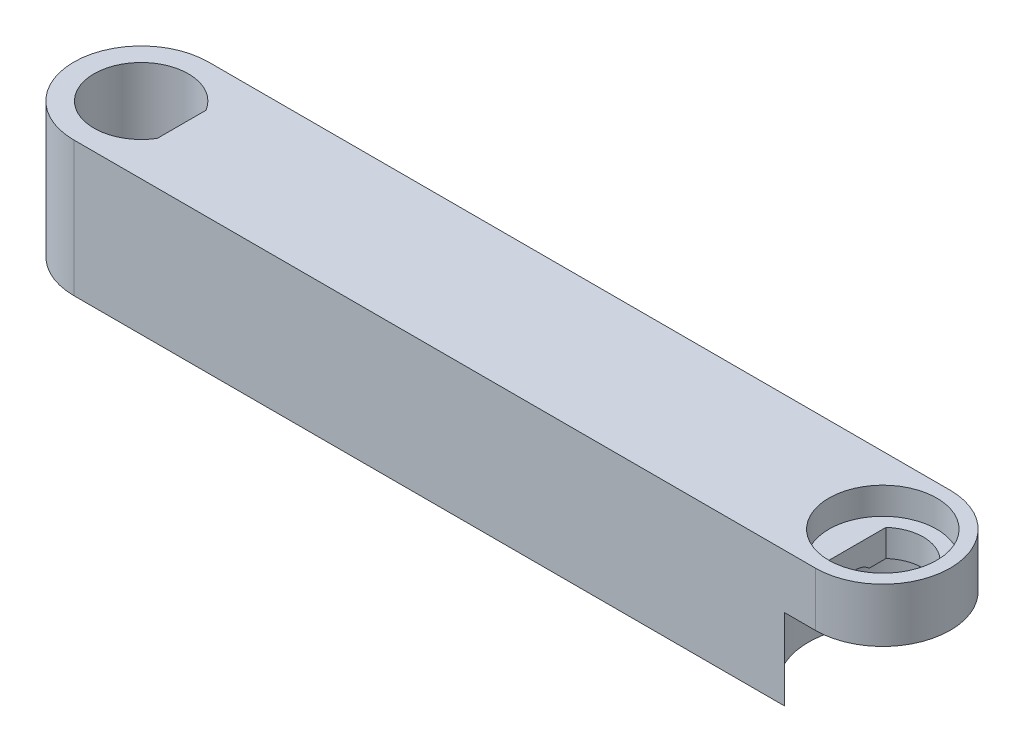
ISO-10303-21;
HEADER;
FILE_DESCRIPTION(('STEP AP214'),'2;1');
FILE_NAME('part.step','',(''),(''),'','','');
FILE_SCHEMA(('AUTOMOTIVE_DESIGN { 1 0 10303 214 1 1 1 1 }'));
ENDSEC;
DATA;
#1=APPLICATION_CONTEXT('core data for automotive mechanical design processes');
#2=APPLICATION_PROTOCOL_DEFINITION('international standard','automotive_design',2000,#1);
#3=PRODUCT_CONTEXT('',#1,'mechanical');
#4=PRODUCT('Part','Part','',(#3));
#5=PRODUCT_RELATED_PRODUCT_CATEGORY('part','',(#4));
#6=PRODUCT_DEFINITION_FORMATION('','',#4);
#7=PRODUCT_DEFINITION_CONTEXT('part definition',#1,'design');
#8=PRODUCT_DEFINITION('design','',#6,#7);
#9=PRODUCT_DEFINITION_SHAPE('','',#8);
#10=(LENGTH_UNIT() NAMED_UNIT(*) SI_UNIT(.MILLI.,.METRE.));
#11=(NAMED_UNIT(*) PLANE_ANGLE_UNIT() SI_UNIT($,.RADIAN.));
#12=(NAMED_UNIT(*) SI_UNIT($,.STERADIAN.) SOLID_ANGLE_UNIT());
#13=UNCERTAINTY_MEASURE_WITH_UNIT(LENGTH_MEASURE(1.E-05),#10,'distance_accuracy_value','');
#14=(GEOMETRIC_REPRESENTATION_CONTEXT(3) GLOBAL_UNCERTAINTY_ASSIGNED_CONTEXT((#13)) GLOBAL_UNIT_ASSIGNED_CONTEXT((#10,
#11,#12)) REPRESENTATION_CONTEXT('',''));
#15=CARTESIAN_POINT('',(0.,0.,0.));
#16=DIRECTION('',(0.,0.,1.));
#17=DIRECTION('',(1.,0.,0.));
#18=AXIS2_PLACEMENT_3D('',#15,#16,#17);
#19=CARTESIAN_POINT('',(0.,50.,25.));
#20=DIRECTION('',(0.,0.,-1.));
#21=DIRECTION('',(-1.,0.,0.));
#22=AXIS2_PLACEMENT_3D('',#19,#20,#21);
#23=PLANE('',#22);
#24=DIRECTION('',(0.,-1.,0.));
#25=VECTOR('',#24,1.);
#26=CARTESIAN_POINT('',(263.54356076261,30.,25.));
#27=LINE('',#26,#25);
#28=CARTESIAN_POINT('',(263.54356076261,30.,25.));
#29=VERTEX_POINT('',#28);
#30=CARTESIAN_POINT('',(263.54356076261,0.,25.));
#31=VERTEX_POINT('',#30);
#32=EDGE_CURVE('E389',#29,#31,#27,.T.);
#33=ORIENTED_EDGE('',*,*,#32,.F.);
#34=DIRECTION('',(1.,0.,0.));
#35=VECTOR('',#34,1.);
#36=CARTESIAN_POINT('',(0.,30.,25.));
#37=LINE('',#36,#35);
#38=CARTESIAN_POINT('',(275.,30.,25.));
#39=VERTEX_POINT('',#38);
#40=EDGE_CURVE('E393',#29,#39,#37,.T.);
#41=ORIENTED_EDGE('',*,*,#40,.T.);
#42=DIRECTION('',(0.,-1.,0.));
#43=VECTOR('',#42,1.);
#44=CARTESIAN_POINT('',(275.,50.,25.));
#45=LINE('',#44,#43);
#46=CARTESIAN_POINT('',(275.,50.,25.));
#47=VERTEX_POINT('',#46);
#48=EDGE_CURVE('E375',#47,#39,#45,.T.);
#49=ORIENTED_EDGE('',*,*,#48,.F.);
#50=DIRECTION('',(1.,0.,0.));
#51=VECTOR('',#50,1.);
#52=CARTESIAN_POINT('',(0.,50.,25.));
#53=LINE('',#52,#51);
#54=CARTESIAN_POINT('',(0.,50.,25.));
#55=VERTEX_POINT('',#54);
#56=EDGE_CURVE('E355',#55,#47,#53,.T.);
#57=ORIENTED_EDGE('',*,*,#56,.F.);
#58=DIRECTION('',(0.,-1.,0.));
#59=VECTOR('',#58,1.);
#60=CARTESIAN_POINT('',(0.,50.,25.));
#61=LINE('',#60,#59);
#62=CARTESIAN_POINT('',(0.,0.,25.));
#63=VERTEX_POINT('',#62);
#64=EDGE_CURVE('E378',#55,#63,#61,.T.);
#65=ORIENTED_EDGE('',*,*,#64,.T.);
#66=DIRECTION('',(1.,0.,0.));
#67=VECTOR('',#66,1.);
#68=CARTESIAN_POINT('',(0.,0.,25.));
#69=LINE('',#68,#67);
#70=EDGE_CURVE('E366',#63,#31,#69,.T.);
#71=ORIENTED_EDGE('',*,*,#70,.T.);
#72=EDGE_LOOP('',(#33,#41,#49,#57,#65,#71));
#73=FACE_BOUND('',#72,.T.);
#74=ADVANCED_FACE('F37',(#73),#23,.F.);
#75=CARTESIAN_POINT('',(0.,50.,-25.));
#76=DIRECTION('',(0.,0.,-1.));
#77=DIRECTION('',(-1.,0.,0.));
#78=AXIS2_PLACEMENT_3D('',#75,#76,#77);
#79=PLANE('',#78);
#80=DIRECTION('',(0.,-1.,0.));
#81=VECTOR('',#80,1.);
#82=CARTESIAN_POINT('',(25.,40.,-25.));
#83=LINE('',#82,#81);
#84=CARTESIAN_POINT('',(25.,40.,-25.));
#85=VERTEX_POINT('',#84);
#86=CARTESIAN_POINT('',(25.,10.,-25.));
#87=VERTEX_POINT('',#86);
#88=EDGE_CURVE('E313',#85,#87,#83,.T.);
#89=ORIENTED_EDGE('',*,*,#88,.T.);
#90=DIRECTION('',(1.,0.,0.));
#91=VECTOR('',#90,1.);
#92=CARTESIAN_POINT('',(25.,10.,-25.));
#93=LINE('',#92,#91);
#94=CARTESIAN_POINT('',(235.,10.,-25.));
#95=VERTEX_POINT('',#94);
#96=EDGE_CURVE('E318',#87,#95,#93,.T.);
#97=ORIENTED_EDGE('',*,*,#96,.T.);
#98=DIRECTION('',(0.,1.,0.));
#99=VECTOR('',#98,1.);
#100=CARTESIAN_POINT('',(235.,40.,-25.));
#101=LINE('',#100,#99);
#102=CARTESIAN_POINT('',(235.,40.,-25.));
#103=VERTEX_POINT('',#102);
#104=EDGE_CURVE('E321',#95,#103,#101,.T.);
#105=ORIENTED_EDGE('',*,*,#104,.T.);
#106=DIRECTION('',(-1.,0.,0.));
#107=VECTOR('',#106,1.);
#108=CARTESIAN_POINT('',(25.,40.,-25.));
#109=LINE('',#108,#107);
#110=EDGE_CURVE('E324',#103,#85,#109,.T.);
#111=ORIENTED_EDGE('',*,*,#110,.T.);
#112=EDGE_LOOP('',(#89,#97,#105,#111));
#113=FACE_BOUND('',#112,.T.);
#114=DIRECTION('',(1.,0.,0.));
#115=VECTOR('',#114,1.);
#116=CARTESIAN_POINT('',(0.,30.,-25.));
#117=LINE('',#116,#115);
#118=CARTESIAN_POINT('',(263.54356076261,30.,-25.));
#119=VERTEX_POINT('',#118);
#120=CARTESIAN_POINT('',(275.,30.,-25.));
#121=VERTEX_POINT('',#120);
#122=EDGE_CURVE('E399',#119,#121,#117,.T.);
#123=ORIENTED_EDGE('',*,*,#122,.F.);
#124=DIRECTION('',(0.,-1.,0.));
#125=VECTOR('',#124,1.);
#126=CARTESIAN_POINT('',(263.54356076261,30.,-25.));
#127=LINE('',#126,#125);
#128=CARTESIAN_POINT('',(263.54356076261,0.,-25.));
#129=VERTEX_POINT('',#128);
#130=EDGE_CURVE('E157',#119,#129,#127,.T.);
#131=ORIENTED_EDGE('',*,*,#130,.T.);
#132=DIRECTION('',(1.,0.,0.));
#133=VECTOR('',#132,1.);
#134=CARTESIAN_POINT('',(0.,0.,-25.));
#135=LINE('',#134,#133);
#136=CARTESIAN_POINT('',(0.,0.,-25.));
#137=VERTEX_POINT('',#136);
#138=EDGE_CURVE('E356',#137,#129,#135,.T.);
#139=ORIENTED_EDGE('',*,*,#138,.F.);
#140=DIRECTION('',(0.,-1.,0.));
#141=VECTOR('',#140,1.);
#142=CARTESIAN_POINT('',(0.,50.,-25.));
#143=LINE('',#142,#141);
#144=CARTESIAN_POINT('',(0.,50.,-25.));
#145=VERTEX_POINT('',#144);
#146=EDGE_CURVE('E363',#145,#137,#143,.T.);
#147=ORIENTED_EDGE('',*,*,#146,.F.);
#148=DIRECTION('',(1.,0.,0.));
#149=VECTOR('',#148,1.);
#150=CARTESIAN_POINT('',(0.,50.,-25.));
#151=LINE('',#150,#149);
#152=CARTESIAN_POINT('',(275.,50.,-25.));
#153=VERTEX_POINT('',#152);
#154=EDGE_CURVE('E360',#145,#153,#151,.T.);
#155=ORIENTED_EDGE('',*,*,#154,.T.);
#156=DIRECTION('',(0.,-1.,0.));
#157=VECTOR('',#156,1.);
#158=CARTESIAN_POINT('',(275.,50.,-25.));
#159=LINE('',#158,#157);
#160=EDGE_CURVE('E372',#153,#121,#159,.T.);
#161=ORIENTED_EDGE('',*,*,#160,.T.);
#162=EDGE_LOOP('',(#123,#131,#139,#147,#155,#161));
#163=FACE_BOUND('',#162,.T.);
#164=ADVANCED_FACE('F193',(#113,#163),#79,.T.);
#165=CARTESIAN_POINT('',(-25.001,24.,0.));
#166=DIRECTION('',(1.,0.,0.));
#167=DIRECTION('',(0.,0.,-1.));
#168=AXIS2_PLACEMENT_3D('',#165,#166,#167);
#169=CYLINDRICAL_SURFACE('',#168,5.);
#170=CARTESIAN_POINT('',(15.,24.,0.));
#171=DIRECTION('',(-1.,0.,0.));
#172=DIRECTION('',(0.,0.,1.));
#173=AXIS2_PLACEMENT_3D('',#170,#171,#172);
#174=CIRCLE('',#173,5.);
#175=CARTESIAN_POINT('',(15.,24.,5.));
#176=VERTEX_POINT('',#175);
#177=EDGE_CURVE('E278',#176,#176,#174,.T.);
#178=ORIENTED_EDGE('',*,*,#177,.T.);
#179=EDGE_LOOP('',(#178));
#180=FACE_BOUND('',#179,.T.);
#181=CARTESIAN_POINT('',(24.,24.,0.));
#182=DIRECTION('',(1.,0.,0.));
#183=DIRECTION('',(0.,1.,0.));
#184=AXIS2_PLACEMENT_3D('',#181,#182,#183);
#185=CIRCLE('',#184,5.);
#186=CARTESIAN_POINT('',(24.,29.,0.));
#187=VERTEX_POINT('',#186);
#188=EDGE_CURVE('E272',#187,#187,#185,.T.);
#189=ORIENTED_EDGE('',*,*,#188,.T.);
#190=EDGE_LOOP('',(#189));
#191=FACE_BOUND('',#190,.T.);
#192=ADVANCED_FACE('F198',(#180,#191),#169,.F.);
#193=CARTESIAN_POINT('',(275.,50.,0.));
#194=DIRECTION('',(0.,-1.,0.));
#195=DIRECTION('',(0.,0.,-1.));
#196=AXIS2_PLACEMENT_3D('',#193,#194,#195);
#197=CYLINDRICAL_SURFACE('',#196,15.);
#198=CARTESIAN_POINT('',(275.,30.,0.));
#199=DIRECTION('',(0.,1.,0.));
#200=DIRECTION('',(0.,0.,1.));
#201=AXIS2_PLACEMENT_3D('',#198,#199,#200);
#202=CIRCLE('',#201,15.);
#203=CARTESIAN_POINT('',(265.,30.,11.1803398874989));
#204=VERTEX_POINT('',#203);
#205=CARTESIAN_POINT('',(265.,30.,-11.1803398874989));
#206=VERTEX_POINT('',#205);
#207=EDGE_CURVE('E401',#204,#206,#202,.T.);
#208=ORIENTED_EDGE('',*,*,#207,.F.);
#209=DIRECTION('',(0.,-1.,0.));
#210=VECTOR('',#209,1.);
#211=CARTESIAN_POINT('',(265.,50.,11.1803398874989));
#212=LINE('',#211,#210);
#213=CARTESIAN_POINT('',(265.,40.,11.1803398874989));
#214=VERTEX_POINT('',#213);
#215=EDGE_CURVE('E297',#214,#204,#212,.T.);
#216=ORIENTED_EDGE('',*,*,#215,.F.);
#217=CARTESIAN_POINT('',(275.,40.,0.));
#218=DIRECTION('',(0.,1.,0.));
#219=DIRECTION('',(0.,0.,1.));
#220=AXIS2_PLACEMENT_3D('',#217,#218,#219);
#221=CIRCLE('',#220,15.);
#222=CARTESIAN_POINT('',(265.,40.,-11.1803398874989));
#223=VERTEX_POINT('',#222);
#224=EDGE_CURVE('E292',#214,#223,#221,.T.);
#225=ORIENTED_EDGE('',*,*,#224,.T.);
#226=DIRECTION('',(0.,-1.,0.));
#227=VECTOR('',#226,1.);
#228=CARTESIAN_POINT('',(265.,50.,-11.1803398874989));
#229=LINE('',#228,#227);
#230=EDGE_CURVE('E300',#223,#206,#229,.T.);
#231=ORIENTED_EDGE('',*,*,#230,.T.);
#232=EDGE_LOOP('',(#208,#216,#225,#231));
#233=FACE_BOUND('',#232,.T.);
#234=ADVANCED_FACE('F245',(#233),#197,.F.);
#235=CARTESIAN_POINT('',(265.,50.,-11.1803398874989));
#236=DIRECTION('',(1.,0.,0.));
#237=DIRECTION('',(0.,0.,-1.));
#238=AXIS2_PLACEMENT_3D('',#235,#236,#237);
#239=PLANE('',#238);
#240=DIRECTION('',(0.,0.,1.));
#241=VECTOR('',#240,1.);
#242=CARTESIAN_POINT('',(265.,30.,-11.1803398874989));
#243=LINE('',#242,#241);
#244=CARTESIAN_POINT('',(265.,30.,-4.89897948556636));
#245=VERTEX_POINT('',#244);
#246=EDGE_CURVE('E148',#206,#245,#243,.T.);
#247=ORIENTED_EDGE('',*,*,#246,.F.);
#248=ORIENTED_EDGE('',*,*,#230,.F.);
#249=DIRECTION('',(0.,0.,1.));
#250=VECTOR('',#249,1.);
#251=CARTESIAN_POINT('',(265.,40.,-11.1803398874989));
#252=LINE('',#251,#250);
#253=EDGE_CURVE('E164',#223,#214,#252,.T.);
#254=ORIENTED_EDGE('',*,*,#253,.T.);
#255=ORIENTED_EDGE('',*,*,#215,.T.);
#256=CARTESIAN_POINT('',(265.,30.,4.89897948556636));
#257=VERTEX_POINT('',#256);
#258=EDGE_CURVE('E159',#257,#204,#243,.T.);
#259=ORIENTED_EDGE('',*,*,#258,.F.);
#260=CARTESIAN_POINT('',(265.,25.,0.));
#261=DIRECTION('',(1.,0.,0.));
#262=DIRECTION('',(0.,0.,-1.));
#263=AXIS2_PLACEMENT_3D('',#260,#261,#262);
#264=CIRCLE('',#263,7.);
#265=EDGE_CURVE('E281',#245,#257,#264,.T.);
#266=ORIENTED_EDGE('',*,*,#265,.F.);
#267=EDGE_LOOP('',(#247,#248,#254,#255,#259,#266));
#268=FACE_BOUND('',#267,.T.);
#269=ADVANCED_FACE('F215',(#268),#239,.T.);
#270=CARTESIAN_POINT('',(0.,50.,0.));
#271=DIRECTION('',(0.,1.,0.));
#272=DIRECTION('',(0.,0.,1.));
#273=AXIS2_PLACEMENT_3D('',#270,#271,#272);
#274=PLANE('',#273);
#275=CARTESIAN_POINT('',(275.,50.,0.));
#276=DIRECTION('',(0.,1.,0.));
#277=DIRECTION('',(0.,0.,1.));
#278=AXIS2_PLACEMENT_3D('',#275,#276,#277);
#279=CIRCLE('',#278,20.);
#280=CARTESIAN_POINT('',(275.,50.,20.));
#281=VERTEX_POINT('',#280);
#282=EDGE_CURVE('E288',#281,#281,#279,.T.);
#283=ORIENTED_EDGE('',*,*,#282,.F.);
#284=EDGE_LOOP('',(#283));
#285=FACE_BOUND('',#284,.T.);
#286=CARTESIAN_POINT('',(0.,50.,0.));
#287=DIRECTION('',(0.,1.,0.));
#288=DIRECTION('',(0.,0.,1.));
#289=AXIS2_PLACEMENT_3D('',#286,#287,#288);
#290=CIRCLE('',#289,25.);
#291=EDGE_CURVE('E352',#55,#145,#290,.F.);
#292=ORIENTED_EDGE('',*,*,#291,.F.);
#293=ORIENTED_EDGE('',*,*,#56,.T.);
#294=CARTESIAN_POINT('',(275.,50.,0.));
#295=DIRECTION('',(0.,1.,0.));
#296=DIRECTION('',(0.,0.,1.));
#297=AXIS2_PLACEMENT_3D('',#294,#295,#296);
#298=CIRCLE('',#297,25.);
#299=EDGE_CURVE('E358',#47,#153,#298,.T.);
#300=ORIENTED_EDGE('',*,*,#299,.T.);
#301=ORIENTED_EDGE('',*,*,#154,.F.);
#302=EDGE_LOOP('',(#292,#293,#300,#301));
#303=FACE_BOUND('',#302,.T.);
#304=DIRECTION('',(0.,0.,-1.));
#305=VECTOR('',#304,1.);
#306=CARTESIAN_POINT('',(15.,50.,-9.01387818865998));
#307=LINE('',#306,#305);
#308=CARTESIAN_POINT('',(15.,50.,9.01387818865998));
#309=VERTEX_POINT('',#308);
#310=CARTESIAN_POINT('',(15.,50.,-9.01387818865998));
#311=VERTEX_POINT('',#310);
#312=EDGE_CURVE('E348',#309,#311,#307,.T.);
#313=ORIENTED_EDGE('',*,*,#312,.F.);
#314=CARTESIAN_POINT('',(0.,50.,0.));
#315=DIRECTION('',(0.,1.,0.));
#316=DIRECTION('',(0.,0.,1.));
#317=AXIS2_PLACEMENT_3D('',#314,#315,#316);
#318=CIRCLE('',#317,17.5);
#319=EDGE_CURVE('E330',#311,#309,#318,.T.);
#320=ORIENTED_EDGE('',*,*,#319,.F.);
#321=EDGE_LOOP('',(#313,#320));
#322=FACE_BOUND('',#321,.T.);
#323=ADVANCED_FACE('F211',(#285,#303,#322),#274,.T.);
#324=CARTESIAN_POINT('',(0.,0.,0.));
#325=DIRECTION('',(0.,1.,0.));
#326=DIRECTION('',(0.,0.,1.));
#327=AXIS2_PLACEMENT_3D('',#324,#325,#326);
#328=PLANE('',#327);
#329=CARTESIAN_POINT('',(275.,0.,0.));
#330=DIRECTION('',(0.,1.,0.));
#331=DIRECTION('',(0.,0.,1.));
#332=AXIS2_PLACEMENT_3D('',#329,#330,#331);
#333=CIRCLE('',#332,27.5);
#334=EDGE_CURVE('E404',#129,#31,#333,.T.);
#335=ORIENTED_EDGE('',*,*,#334,.T.);
#336=ORIENTED_EDGE('',*,*,#70,.F.);
#337=CARTESIAN_POINT('',(0.,0.,0.));
#338=DIRECTION('',(0.,1.,0.));
#339=DIRECTION('',(0.,0.,1.));
#340=AXIS2_PLACEMENT_3D('',#337,#338,#339);
#341=CIRCLE('',#340,25.);
#342=EDGE_CURVE('E351',#63,#137,#341,.F.);
#343=ORIENTED_EDGE('',*,*,#342,.T.);
#344=ORIENTED_EDGE('',*,*,#138,.T.);
#345=EDGE_LOOP('',(#335,#336,#343,#344));
#346=FACE_BOUND('',#345,.T.);
#347=CARTESIAN_POINT('',(0.,0.,0.));
#348=DIRECTION('',(0.,1.,0.));
#349=DIRECTION('',(0.,0.,1.));
#350=AXIS2_PLACEMENT_3D('',#347,#348,#349);
#351=CIRCLE('',#350,17.5);
#352=CARTESIAN_POINT('',(15.,0.,-9.01387818865998));
#353=VERTEX_POINT('',#352);
#354=CARTESIAN_POINT('',(15.,0.,9.01387818865998));
#355=VERTEX_POINT('',#354);
#356=EDGE_CURVE('E337',#353,#355,#351,.T.);
#357=ORIENTED_EDGE('',*,*,#356,.T.);
#358=DIRECTION('',(0.,0.,-1.));
#359=VECTOR('',#358,1.);
#360=CARTESIAN_POINT('',(15.,0.,-9.01387818865998));
#361=LINE('',#360,#359);
#362=EDGE_CURVE('E340',#355,#353,#361,.T.);
#363=ORIENTED_EDGE('',*,*,#362,.T.);
#364=EDGE_LOOP('',(#357,#363));
#365=FACE_BOUND('',#364,.T.);
#366=ADVANCED_FACE('F208',(#346,#365),#328,.F.);
#367=CARTESIAN_POINT('',(0.,50.,0.));
#368=DIRECTION('',(0.,-1.,0.));
#369=DIRECTION('',(0.,0.,-1.));
#370=AXIS2_PLACEMENT_3D('',#367,#368,#369);
#371=CYLINDRICAL_SURFACE('',#370,25.);
#372=ORIENTED_EDGE('',*,*,#342,.F.);
#373=ORIENTED_EDGE('',*,*,#64,.F.);
#374=ORIENTED_EDGE('',*,*,#291,.T.);
#375=ORIENTED_EDGE('',*,*,#146,.T.);
#376=EDGE_LOOP('',(#372,#373,#374,#375));
#377=FACE_BOUND('',#376,.T.);
#378=ADVANCED_FACE('F39',(#377),#371,.T.);
#379=CARTESIAN_POINT('',(275.,50.,0.));
#380=DIRECTION('',(0.,-1.,0.));
#381=DIRECTION('',(0.,0.,-1.));
#382=AXIS2_PLACEMENT_3D('',#379,#380,#381);
#383=CYLINDRICAL_SURFACE('',#382,25.);
#384=ORIENTED_EDGE('',*,*,#48,.T.);
#385=CARTESIAN_POINT('',(275.,30.,0.));
#386=DIRECTION('',(0.,1.,0.));
#387=DIRECTION('',(0.,0.,1.));
#388=AXIS2_PLACEMENT_3D('',#385,#386,#387);
#389=CIRCLE('',#388,25.);
#390=EDGE_CURVE('E396',#39,#121,#389,.T.);
#391=ORIENTED_EDGE('',*,*,#390,.T.);
#392=ORIENTED_EDGE('',*,*,#160,.F.);
#393=ORIENTED_EDGE('',*,*,#299,.F.);
#394=EDGE_LOOP('',(#384,#391,#392,#393));
#395=FACE_BOUND('',#394,.T.);
#396=ADVANCED_FACE('F203',(#395),#383,.T.);
#397=CARTESIAN_POINT('',(0.,50.001,0.));
#398=DIRECTION('',(0.,-1.,0.));
#399=DIRECTION('',(0.,0.,-1.));
#400=AXIS2_PLACEMENT_3D('',#397,#398,#399);
#401=CYLINDRICAL_SURFACE('',#400,17.5);
#402=ORIENTED_EDGE('',*,*,#319,.T.);
#403=DIRECTION('',(0.,-1.,0.));
#404=VECTOR('',#403,1.);
#405=CARTESIAN_POINT('',(15.,50.001,9.01387818865998));
#406=LINE('',#405,#404);
#407=EDGE_CURVE('E346',#309,#355,#406,.T.);
#408=ORIENTED_EDGE('',*,*,#407,.T.);
#409=ORIENTED_EDGE('',*,*,#356,.F.);
#410=DIRECTION('',(0.,-1.,0.));
#411=VECTOR('',#410,1.);
#412=CARTESIAN_POINT('',(15.,50.001,-9.01387818865998));
#413=LINE('',#412,#411);
#414=EDGE_CURVE('E343',#311,#353,#413,.T.);
#415=ORIENTED_EDGE('',*,*,#414,.F.);
#416=EDGE_LOOP('',(#402,#408,#409,#415));
#417=FACE_BOUND('',#416,.T.);
#418=ADVANCED_FACE('F205',(#417),#401,.F.);
#419=CARTESIAN_POINT('',(15.,50.001,-9.01387818865998));
#420=DIRECTION('',(-1.,0.,0.));
#421=DIRECTION('',(0.,0.,1.));
#422=AXIS2_PLACEMENT_3D('',#419,#420,#421);
#423=PLANE('',#422);
#424=ORIENTED_EDGE('',*,*,#177,.F.);
#425=EDGE_LOOP('',(#424));
#426=FACE_BOUND('',#425,.T.);
#427=ORIENTED_EDGE('',*,*,#312,.T.);
#428=ORIENTED_EDGE('',*,*,#414,.T.);
#429=ORIENTED_EDGE('',*,*,#362,.F.);
#430=ORIENTED_EDGE('',*,*,#407,.F.);
#431=EDGE_LOOP('',(#427,#428,#429,#430));
#432=FACE_BOUND('',#431,.T.);
#433=ADVANCED_FACE('F219',(#426,#432),#423,.T.);
#434=CARTESIAN_POINT('',(25.,40.,-25.));
#435=DIRECTION('',(-1.,0.,0.));
#436=DIRECTION('',(0.,-1.,0.));
#437=AXIS2_PLACEMENT_3D('',#434,#435,#436);
#438=PLANE('',#437);
#439=CARTESIAN_POINT('',(25.,24.,0.));
#440=DIRECTION('',(1.,0.,0.));
#441=DIRECTION('',(0.,1.,0.));
#442=AXIS2_PLACEMENT_3D('',#439,#440,#441);
#443=CIRCLE('',#442,7.5);
#444=CARTESIAN_POINT('',(25.,31.5,0.));
#445=VERTEX_POINT('',#444);
#446=EDGE_CURVE('E276',#445,#445,#443,.T.);
#447=ORIENTED_EDGE('',*,*,#446,.F.);
#448=EDGE_LOOP('',(#447));
#449=FACE_BOUND('',#448,.T.);
#450=DIRECTION('',(0.,0.,1.));
#451=VECTOR('',#450,1.);
#452=CARTESIAN_POINT('',(25.,10.,-25.));
#453=LINE('',#452,#451);
#454=CARTESIAN_POINT('',(25.,10.,15.));
#455=VERTEX_POINT('',#454);
#456=EDGE_CURVE('E327',#87,#455,#453,.T.);
#457=ORIENTED_EDGE('',*,*,#456,.F.);
#458=ORIENTED_EDGE('',*,*,#88,.F.);
#459=DIRECTION('',(0.,0.,1.));
#460=VECTOR('',#459,1.);
#461=CARTESIAN_POINT('',(25.,40.,-25.));
#462=LINE('',#461,#460);
#463=CARTESIAN_POINT('',(25.,40.,15.));
#464=VERTEX_POINT('',#463);
#465=EDGE_CURVE('E328',#85,#464,#462,.T.);
#466=ORIENTED_EDGE('',*,*,#465,.T.);
#467=DIRECTION('',(0.,1.,0.));
#468=VECTOR('',#467,1.);
#469=CARTESIAN_POINT('',(25.,40.,15.));
#470=LINE('',#469,#468);
#471=EDGE_CURVE('E310',#455,#464,#470,.T.);
#472=ORIENTED_EDGE('',*,*,#471,.F.);
#473=EDGE_LOOP('',(#457,#458,#466,#472));
#474=FACE_BOUND('',#473,.T.);
#475=ADVANCED_FACE('F223',(#449,#474),#438,.F.);
#476=CARTESIAN_POINT('',(25.,40.,-25.));
#477=DIRECTION('',(0.,1.,0.));
#478=DIRECTION('',(-1.,0.,0.));
#479=AXIS2_PLACEMENT_3D('',#476,#477,#478);
#480=PLANE('',#479);
#481=ORIENTED_EDGE('',*,*,#465,.F.);
#482=ORIENTED_EDGE('',*,*,#110,.F.);
#483=DIRECTION('',(0.,0.,1.));
#484=VECTOR('',#483,1.);
#485=CARTESIAN_POINT('',(235.,40.,-25.));
#486=LINE('',#485,#484);
#487=CARTESIAN_POINT('',(235.,40.,15.));
#488=VERTEX_POINT('',#487);
#489=EDGE_CURVE('E331',#103,#488,#486,.T.);
#490=ORIENTED_EDGE('',*,*,#489,.T.);
#491=DIRECTION('',(1.,0.,0.));
#492=VECTOR('',#491,1.);
#493=CARTESIAN_POINT('',(25.,40.,15.));
#494=LINE('',#493,#492);
#495=EDGE_CURVE('E303',#464,#488,#494,.T.);
#496=ORIENTED_EDGE('',*,*,#495,.F.);
#497=EDGE_LOOP('',(#481,#482,#490,#496));
#498=FACE_BOUND('',#497,.T.);
#499=ADVANCED_FACE('F227',(#498),#480,.F.);
#500=CARTESIAN_POINT('',(235.,40.,-25.));
#501=DIRECTION('',(1.,0.,0.));
#502=DIRECTION('',(0.,0.,-1.));
#503=AXIS2_PLACEMENT_3D('',#500,#501,#502);
#504=PLANE('',#503);
#505=CARTESIAN_POINT('',(235.,25.,0.));
#506=DIRECTION('',(1.,0.,0.));
#507=DIRECTION('',(0.,0.,-1.));
#508=AXIS2_PLACEMENT_3D('',#505,#506,#507);
#509=CIRCLE('',#508,9.);
#510=CARTESIAN_POINT('',(235.,25.,-9.));
#511=VERTEX_POINT('',#510);
#512=EDGE_CURVE('E385',#511,#511,#509,.T.);
#513=ORIENTED_EDGE('',*,*,#512,.T.);
#514=EDGE_LOOP('',(#513));
#515=FACE_BOUND('',#514,.T.);
#516=ORIENTED_EDGE('',*,*,#489,.F.);
#517=ORIENTED_EDGE('',*,*,#104,.F.);
#518=DIRECTION('',(0.,0.,1.));
#519=VECTOR('',#518,1.);
#520=CARTESIAN_POINT('',(235.,10.,-25.));
#521=LINE('',#520,#519);
#522=CARTESIAN_POINT('',(235.,10.,15.));
#523=VERTEX_POINT('',#522);
#524=EDGE_CURVE('E333',#95,#523,#521,.T.);
#525=ORIENTED_EDGE('',*,*,#524,.T.);
#526=DIRECTION('',(0.,-1.,0.));
#527=VECTOR('',#526,1.);
#528=CARTESIAN_POINT('',(235.,40.,15.));
#529=LINE('',#528,#527);
#530=EDGE_CURVE('E304',#488,#523,#529,.T.);
#531=ORIENTED_EDGE('',*,*,#530,.F.);
#532=EDGE_LOOP('',(#516,#517,#525,#531));
#533=FACE_BOUND('',#532,.T.);
#534=ADVANCED_FACE('F233',(#515,#533),#504,.F.);
#535=CARTESIAN_POINT('',(25.,10.,-25.));
#536=DIRECTION('',(0.,-1.,0.));
#537=DIRECTION('',(1.,0.,0.));
#538=AXIS2_PLACEMENT_3D('',#535,#536,#537);
#539=PLANE('',#538);
#540=ORIENTED_EDGE('',*,*,#524,.F.);
#541=ORIENTED_EDGE('',*,*,#96,.F.);
#542=ORIENTED_EDGE('',*,*,#456,.T.);
#543=DIRECTION('',(-1.,0.,0.));
#544=VECTOR('',#543,1.);
#545=CARTESIAN_POINT('',(25.,10.,15.));
#546=LINE('',#545,#544);
#547=EDGE_CURVE('E307',#523,#455,#546,.T.);
#548=ORIENTED_EDGE('',*,*,#547,.F.);
#549=EDGE_LOOP('',(#540,#541,#542,#548));
#550=FACE_BOUND('',#549,.T.);
#551=ADVANCED_FACE('F229',(#550),#539,.F.);
#552=CARTESIAN_POINT('',(0.,50.,15.));
#553=DIRECTION('',(0.,0.,-1.));
#554=DIRECTION('',(-1.,0.,0.));
#555=AXIS2_PLACEMENT_3D('',#552,#553,#554);
#556=PLANE('',#555);
#557=ORIENTED_EDGE('',*,*,#547,.T.);
#558=ORIENTED_EDGE('',*,*,#471,.T.);
#559=ORIENTED_EDGE('',*,*,#495,.T.);
#560=ORIENTED_EDGE('',*,*,#530,.T.);
#561=EDGE_LOOP('',(#557,#558,#559,#560));
#562=FACE_BOUND('',#561,.T.);
#563=ADVANCED_FACE('F232',(#562),#556,.T.);
#564=CARTESIAN_POINT('',(275.,40.,0.));
#565=DIRECTION('',(0.,1.,0.));
#566=DIRECTION('',(0.,0.,1.));
#567=AXIS2_PLACEMENT_3D('',#564,#565,#566);
#568=CYLINDRICAL_SURFACE('',#567,20.);
#569=CARTESIAN_POINT('',(275.,40.,0.));
#570=DIRECTION('',(0.,1.,0.));
#571=DIRECTION('',(0.,0.,1.));
#572=AXIS2_PLACEMENT_3D('',#569,#570,#571);
#573=CIRCLE('',#572,20.);
#574=CARTESIAN_POINT('',(275.,40.,20.));
#575=VERTEX_POINT('',#574);
#576=EDGE_CURVE('E289',#575,#575,#573,.T.);
#577=ORIENTED_EDGE('',*,*,#576,.F.);
#578=EDGE_LOOP('',(#577));
#579=FACE_BOUND('',#578,.T.);
#580=ORIENTED_EDGE('',*,*,#282,.T.);
#581=EDGE_LOOP('',(#580));
#582=FACE_BOUND('',#581,.T.);
#583=ADVANCED_FACE('F243',(#579,#582),#568,.F.);
#584=CARTESIAN_POINT('',(275.,40.,0.));
#585=DIRECTION('',(0.,1.,0.));
#586=DIRECTION('',(0.,0.,1.));
#587=AXIS2_PLACEMENT_3D('',#584,#585,#586);
#588=PLANE('',#587);
#589=ORIENTED_EDGE('',*,*,#253,.F.);
#590=ORIENTED_EDGE('',*,*,#224,.F.);
#591=EDGE_LOOP('',(#589,#590));
#592=FACE_BOUND('',#591,.T.);
#593=ORIENTED_EDGE('',*,*,#576,.T.);
#594=EDGE_LOOP('',(#593));
#595=FACE_BOUND('',#594,.T.);
#596=ADVANCED_FACE('F254',(#592,#595),#588,.T.);
#597=CARTESIAN_POINT('',(24.,24.,0.));
#598=DIRECTION('',(1.,0.,0.));
#599=DIRECTION('',(0.,1.,0.));
#600=AXIS2_PLACEMENT_3D('',#597,#598,#599);
#601=CYLINDRICAL_SURFACE('',#600,7.5);
#602=CARTESIAN_POINT('',(24.,24.,0.));
#603=DIRECTION('',(1.,0.,0.));
#604=DIRECTION('',(0.,1.,0.));
#605=AXIS2_PLACEMENT_3D('',#602,#603,#604);
#606=CIRCLE('',#605,7.5);
#607=CARTESIAN_POINT('',(24.,31.5,0.));
#608=VERTEX_POINT('',#607);
#609=EDGE_CURVE('E275',#608,#608,#606,.T.);
#610=ORIENTED_EDGE('',*,*,#609,.F.);
#611=EDGE_LOOP('',(#610));
#612=FACE_BOUND('',#611,.T.);
#613=ORIENTED_EDGE('',*,*,#446,.T.);
#614=EDGE_LOOP('',(#613));
#615=FACE_BOUND('',#614,.T.);
#616=ADVANCED_FACE('F258',(#612,#615),#601,.F.);
#617=CARTESIAN_POINT('',(24.,24.,0.));
#618=DIRECTION('',(1.,0.,0.));
#619=DIRECTION('',(0.,1.,0.));
#620=AXIS2_PLACEMENT_3D('',#617,#618,#619);
#621=PLANE('',#620);
#622=ORIENTED_EDGE('',*,*,#188,.F.);
#623=EDGE_LOOP('',(#622));
#624=FACE_BOUND('',#623,.T.);
#625=ORIENTED_EDGE('',*,*,#609,.T.);
#626=EDGE_LOOP('',(#625));
#627=FACE_BOUND('',#626,.T.);
#628=ADVANCED_FACE('F189',(#624,#627),#621,.T.);
#629=CARTESIAN_POINT('',(284.798989873223,25.,0.));
#630=DIRECTION('',(-1.,0.,0.));
#631=DIRECTION('',(0.,0.,1.));
#632=AXIS2_PLACEMENT_3D('',#629,#630,#631);
#633=CYLINDRICAL_SURFACE('',#632,7.);
#634=DIRECTION('',(-1.,0.,0.));
#635=VECTOR('',#634,1.);
#636=CARTESIAN_POINT('',(284.798989873223,30.,-4.89897948556636));
#637=LINE('',#636,#635);
#638=CARTESIAN_POINT('',(247.93988174453,30.,-4.89897948556636));
#639=VERTEX_POINT('',#638);
#640=EDGE_CURVE('E12',#245,#639,#637,.T.);
#641=ORIENTED_EDGE('',*,*,#640,.F.);
#642=ORIENTED_EDGE('',*,*,#265,.T.);
#643=DIRECTION('',(-1.,0.,0.));
#644=VECTOR('',#643,1.);
#645=CARTESIAN_POINT('',(284.798989873223,30.,4.89897948556636));
#646=LINE('',#645,#644);
#647=CARTESIAN_POINT('',(247.93988174453,30.,4.89897948556636));
#648=VERTEX_POINT('',#647);
#649=EDGE_CURVE('E163',#648,#257,#646,.F.);
#650=ORIENTED_EDGE('',*,*,#649,.F.);
#651=CARTESIAN_POINT('',(247.93988174453,30.,4.89897948556636));
#652=CARTESIAN_POINT('',(247.965219968874,29.8628860947373,5.03894302066566));
#653=CARTESIAN_POINT('',(247.99063430006,29.7198810057591,5.17312109411322));
#654=CARTESIAN_POINT('',(248.040916679151,29.4230665316552,5.42907256199531));
#655=CARTESIAN_POINT('',(248.065784695749,29.2692565294621,5.55084524698486));
#656=CARTESIAN_POINT('',(248.114287993629,28.951727337262,5.78120771336965));
#657=CARTESIAN_POINT('',(248.137922497402,28.7880020345822,5.8897892359976));
#658=CARTESIAN_POINT('',(248.183264961752,28.4518125894094,6.09291013478928));
#659=CARTESIAN_POINT('',(248.204972992305,28.2793487646871,6.18745002107753));
#660=CARTESIAN_POINT('',(248.245851914618,27.9266284489076,6.36188649022957));
#661=CARTESIAN_POINT('',(248.26501989376,27.7463633210388,6.4417663024317));
#662=CARTESIAN_POINT('',(248.300214736562,27.3794683288046,6.58612108952547));
#663=CARTESIAN_POINT('',(248.316241632133,27.1928385291194,6.65059622091238));
#664=CARTESIAN_POINT('',(248.344652864702,26.8146763994839,6.76356883390713));
#665=CARTESIAN_POINT('',(248.357039796473,26.6231476681632,6.8120777001525));
#666=CARTESIAN_POINT('',(248.37779901368,26.2364670922794,6.89276098631127));
#667=CARTESIAN_POINT('',(248.386171404521,26.0413153429818,6.92493583509041));
#668=CARTESIAN_POINT('',(248.398503549954,25.6530391335286,6.97215668799057));
#669=CARTESIAN_POINT('',(248.402553540226,25.4599601002792,6.98755311392553));
#670=CARTESIAN_POINT('',(248.406430946198,25.0730796370276,7.00229565730968));
#671=CARTESIAN_POINT('',(248.406256911369,24.8792779817204,7.00163626119834));
#672=CARTESIAN_POINT('',(248.401688389115,24.4924838812122,6.9842608084985));
#673=CARTESIAN_POINT('',(248.397294701251,24.299491289664,6.96754779383034));
#674=CARTESIAN_POINT('',(248.38442050138,23.9156174610115,6.91820617320764));
#675=CARTESIAN_POINT('',(248.375938473994,23.724737033657,6.88557166576091));
#676=CARTESIAN_POINT('',(248.355310944415,23.3495498322369,6.80530895125623));
#677=CARTESIAN_POINT('',(248.343225933313,23.1651867811975,6.7579277917612));
#678=CARTESIAN_POINT('',(248.315693375456,22.8010941768024,6.64838082378179));
#679=CARTESIAN_POINT('',(248.30024462028,22.6213663146508,6.58620970128074));
#680=CARTESIAN_POINT('',(248.266432446067,22.26786079516,6.44759252482499));
#681=CARTESIAN_POINT('',(248.248070020758,22.0940811336226,6.37115133621402));
#682=CARTESIAN_POINT('',(248.208930852523,21.7534595623454,6.20450946224465));
#683=CARTESIAN_POINT('',(248.188153251689,21.5866201466409,6.11430388397874));
#684=CARTESIAN_POINT('',(248.144289730656,21.2574949797494,5.91870605077));
#685=CARTESIAN_POINT('',(248.121163919111,21.0953831538225,5.81303004268081));
#686=CARTESIAN_POINT('',(248.073632176681,20.7805804621638,5.58872564805859));
#687=CARTESIAN_POINT('',(248.049226217186,20.6278898071544,5.47009697197862));
#688=CARTESIAN_POINT('',(247.999793440632,20.3328469563147,5.22063359915909));
#689=CARTESIAN_POINT('',(247.974766417598,20.1904982535628,5.08979481212943));
#690=CARTESIAN_POINT('',(247.924783662071,19.9171470429619,4.81683521144775));
#691=CARTESIAN_POINT('',(247.899827908808,19.786140812661,4.67471812875733));
#692=CARTESIAN_POINT('',(247.850019255296,19.5330777218104,4.3763001280623));
#693=CARTESIAN_POINT('',(247.825185237354,19.4113346213948,4.21972977230056));
#694=CARTESIAN_POINT('',(247.776992775667,19.181516877608,3.89673270105343));
#695=CARTESIAN_POINT('',(247.753633794213,19.0734372388065,3.73030962063907));
#696=CARTESIAN_POINT('',(247.709031274266,18.8716508410019,3.3886157618017));
#697=CARTESIAN_POINT('',(247.687788457441,18.7779489793521,3.21334199556069));
#698=CARTESIAN_POINT('',(247.648038169129,18.6057183285664,2.85527806260235));
#699=CARTESIAN_POINT('',(247.629529591747,18.5271834010147,2.67249097318521));
#700=CARTESIAN_POINT('',(247.59591446198,18.3864886411678,2.30224757103478));
#701=CARTESIAN_POINT('',(247.580779711806,18.324192284567,2.11484571846359));
#702=CARTESIAN_POINT('',(247.554144503977,18.2156241800738,1.73527885113514));
#703=CARTESIAN_POINT('',(247.542642646419,18.1693462589703,1.54311570195726));
#704=CARTESIAN_POINT('',(247.523595559707,18.0931799991716,1.15536816726626));
#705=CARTESIAN_POINT('',(247.516050431654,18.0632920792688,0.959783694464283));
#706=CARTESIAN_POINT('',(247.505136098244,18.0201734893343,0.566672796839451));
#707=CARTESIAN_POINT('',(247.501766800771,18.0069424518626,0.369146414950732));
#708=CARTESIAN_POINT('',(247.499336161687,17.9973912358988,-0.0207857069629615));
#709=CARTESIAN_POINT('',(247.500156513882,18.0006066508865,-0.213179494360335));
#710=CARTESIAN_POINT('',(247.505811854048,18.0228589020749,-0.597058035277559));
#711=CARTESIAN_POINT('',(247.510648225925,18.0419011921576,-0.788542452552739));
#712=CARTESIAN_POINT('',(247.524201879517,18.0956422100409,-1.16908291487629));
#713=CARTESIAN_POINT('',(247.532917630379,18.1303347621148,-1.35813988757886));
#714=CARTESIAN_POINT('',(247.553995667493,18.2151022220275,-1.73263814576958));
#715=CARTESIAN_POINT('',(247.566359313686,18.2651828668575,-1.91807805527578));
#716=CARTESIAN_POINT('',(247.594333320344,18.380056466208,-2.28315608215664));
#717=CARTESIAN_POINT('',(247.609928659801,18.4447814767892,-2.46281674942918));
#718=CARTESIAN_POINT('',(247.643991920362,18.5885993863249,-2.81608353039628));
#719=CARTESIAN_POINT('',(247.662460879663,18.6676974798072,-2.98968742800691));
#720=CARTESIAN_POINT('',(247.701777177617,18.8396453552232,-3.3296097608275));
#721=CARTESIAN_POINT('',(247.722623956552,18.9324919024214,-3.49592989786541));
#722=CARTESIAN_POINT('',(247.766164107329,19.1313350617066,-3.82033781616744));
#723=CARTESIAN_POINT('',(247.788858132639,19.2373363343313,-3.97842265145392));
#724=CARTESIAN_POINT('',(247.836089714926,19.4645972770326,-4.28920814452512));
#725=CARTESIAN_POINT('',(247.860659394478,19.5861752401583,-4.4416712507606));
#726=CARTESIAN_POINT('',(247.910448631399,19.8415627153274,-4.73587064574847));
#727=CARTESIAN_POINT('',(247.935668199829,19.9753724356467,-4.87760675177199));
#728=CARTESIAN_POINT('',(247.986077521793,20.2543877632577,-5.14947728259768));
#729=CARTESIAN_POINT('',(248.0112672638,20.399596855663,-5.27960813316426));
#730=CARTESIAN_POINT('',(248.060907610637,20.7003850108356,-5.52731914647914));
#731=CARTESIAN_POINT('',(248.085358466625,20.8559604909274,-5.64490360914883));
#732=CARTESIAN_POINT('',(248.133286642049,21.1794841406893,-5.86882170527154));
#733=CARTESIAN_POINT('',(248.156737714247,21.347607495008,-5.97490804777839));
#734=CARTESIAN_POINT('',(248.201476296728,21.6924209463699,-6.17247010181409));
#735=CARTESIAN_POINT('',(248.22276462615,21.8691077622725,-6.26395135257258));
#736=CARTESIAN_POINT('',(248.262553274595,22.2299431611335,-6.43166993978254));
#737=CARTESIAN_POINT('',(248.281052785414,22.4140938876028,-6.50790285932479));
#738=CARTESIAN_POINT('',(248.314679314096,22.7884244821087,-6.64444179915956));
#739=CARTESIAN_POINT('',(248.329807730824,22.9786018117965,-6.70475442763549));
#740=CARTESIAN_POINT('',(248.355992843956,23.360268325535,-6.80805950793824));
#741=CARTESIAN_POINT('',(248.367116565152,23.5516754014311,-6.85133832151399));
#742=CARTESIAN_POINT('',(248.385311417087,23.9375626048114,-6.92168147146719));
#743=CARTESIAN_POINT('',(248.392384121152,24.1320415090692,-6.94875210292916));
#744=CARTESIAN_POINT('',(248.402261233012,24.5226841733751,-6.98646361160519));
#745=CARTESIAN_POINT('',(248.405065860233,24.7188478462861,-6.99710533344613));
#746=CARTESIAN_POINT('',(248.406318628007,25.1113874487624,-7.00186534103631));
#747=CARTESIAN_POINT('',(248.404766853407,25.3077633741193,-6.99598394859806));
#748=CARTESIAN_POINT('',(248.397457913062,25.6938942270845,-6.96813831562669));
#749=CARTESIAN_POINT('',(248.391816736235,25.8836835268048,-6.9466176166118));
#750=CARTESIAN_POINT('',(248.376625749763,26.2607780288812,-6.88816769576931));
#751=CARTESIAN_POINT('',(248.367074678704,26.4480824093974,-6.85123350114883));
#752=CARTESIAN_POINT('',(248.344341771214,26.8188942848438,-6.76224743811406));
#753=CARTESIAN_POINT('',(248.331158882928,27.0024006632097,-6.71019118978132));
#754=CARTESIAN_POINT('',(248.301545214116,27.3643225916245,-6.5913774401124));
#755=CARTESIAN_POINT('',(248.28511435213,27.542738013863,-6.52461957005253));
#756=CARTESIAN_POINT('',(248.249330376254,27.8946880756138,-6.37632612404351));
#757=CARTESIAN_POINT('',(248.229955190331,28.0681729882147,-6.29467791030584));
#758=CARTESIAN_POINT('',(248.188932264562,28.407598901522,-6.11758934578478));
#759=CARTESIAN_POINT('',(248.167285268563,28.5735423461491,-6.02215350558458));
#760=CARTESIAN_POINT('',(248.122341160001,28.8966804889458,-5.81827599846845));
#761=CARTESIAN_POINT('',(248.099046257293,29.0538864170335,-5.70985161881417));
#762=CARTESIAN_POINT('',(248.051417461865,29.358756310892,-5.48065517736597));
#763=CARTESIAN_POINT('',(248.027084125384,29.506425281208,-5.35988967895373));
#764=CARTESIAN_POINT('',(247.992142137521,29.7093460074764,-5.1796341540997));
#765=CARTESIAN_POINT('',(247.981693171322,29.7688811134581,-5.12487240174219));
#766=CARTESIAN_POINT('',(247.960785985776,29.8859394277805,-5.01339373876822));
#767=CARTESIAN_POINT('',(247.950327796335,29.9434651619902,-4.95667947485177));
#768=CARTESIAN_POINT('',(247.93988174453,30.,-4.89897948556636));
#769=B_SPLINE_CURVE_WITH_KNOTS('',3,(#651,#652,#653,#654,#655,#656,#657,#658,#659,#660,#661,
#662,#663,#664,#665,#666,#667,#668,#669,#670,#671,#672,#673,#674,#675,#676,#677,#678,#679,#680,
#681,#682,#683,#684,#685,#686,#687,#688,#689,#690,#691,#692,#693,#694,#695,#696,#697,#698,#699,
#700,#701,#702,#703,#704,#705,#706,#707,#708,#709,#710,#711,#712,#713,#714,#715,#716,#717,#718,
#719,#720,#721,#722,#723,#724,#725,#726,#727,#728,#729,#730,#731,#732,#733,#734,#735,#736,#737,
#738,#739,#740,#741,#742,#743,#744,#745,#746,#747,#748,#749,#750,#751,#752,#753,#754,#755,#756,
#757,#758,#759,#760,#761,#762,#763,#764,#765,#766,#767,#768),.UNSPECIFIED.,.F.,.F.,(4,2,2,2,2,2,
2,2,2,2,2,2,2,2,2,2,2,2,2,2,2,2,2,2,2,2,2,2,2,2,2,2,2,2,2,2,2,2,2,2,2,2,2,2,2,2,2,2,2,2,2,2,2,2,
2,2,2,2,4),(0.,0.592525327274885,1.18508452115757,1.7780128151989,2.37091956322693,
2.96450040661957,3.55807521960209,4.15122586651065,4.74436093885836,5.32485565345758,
5.90554971243536,6.48613376028549,7.06693317226089,7.63848347669505,8.21023944948477,
8.78180083834629,9.35356587882612,9.93757016518591,10.5215875091862,11.1058012014843,
11.6898224298724,12.2887498124336,12.8874575869388,13.4863688425208,14.0850371942738,
14.6784969205344,15.2717276829939,15.8649736027965,16.4582064357461,17.0347819477906,
17.6115562280129,18.1881031070075,18.7648651956474,19.339004304478,19.9133513251983,
20.4875634276603,21.0619795494481,21.6509345503959,22.239899581629,22.8290453828502,
23.4179886179593,24.0177860333943,24.6173554222504,25.2170982347162,25.8165917134924,
26.4055258588781,26.9942311199158,27.5829061140123,28.1715696428572,28.7441591972179,
29.3169336267867,29.8898741191741,30.4628289828192,31.04031270634,31.6176079337051,
32.1941431656629,32.7703733588434,33.0150220391122,33.2593512245639),.UNSPECIFIED.);
#770=EDGE_CURVE('E45',#648,#639,#769,.T.);
#771=ORIENTED_EDGE('',*,*,#770,.T.);
#772=EDGE_LOOP('',(#641,#642,#650,#771));
#773=FACE_BOUND('',#772,.T.);
#774=CARTESIAN_POINT('',(238.,25.,0.));
#775=DIRECTION('',(1.,0.,0.));
#776=DIRECTION('',(0.,0.,-1.));
#777=AXIS2_PLACEMENT_3D('',#774,#775,#776);
#778=CIRCLE('',#777,7.);
#779=CARTESIAN_POINT('',(238.,25.,-7.));
#780=VERTEX_POINT('',#779);
#781=EDGE_CURVE('E381',#780,#780,#778,.T.);
#782=ORIENTED_EDGE('',*,*,#781,.F.);
#783=EDGE_LOOP('',(#782));
#784=FACE_BOUND('',#783,.T.);
#785=ADVANCED_FACE('F161',(#773,#784),#633,.F.);
#786=CARTESIAN_POINT('',(238.,25.,0.));
#787=DIRECTION('',(-1.,0.,0.));
#788=DIRECTION('',(0.,0.,1.));
#789=AXIS2_PLACEMENT_3D('',#786,#787,#788);
#790=CYLINDRICAL_SURFACE('',#789,9.);
#791=CARTESIAN_POINT('',(238.,25.,0.));
#792=DIRECTION('',(1.,0.,0.));
#793=DIRECTION('',(0.,0.,-1.));
#794=AXIS2_PLACEMENT_3D('',#791,#792,#793);
#795=CIRCLE('',#794,9.);
#796=CARTESIAN_POINT('',(238.,25.,-9.));
#797=VERTEX_POINT('',#796);
#798=EDGE_CURVE('E383',#797,#797,#795,.T.);
#799=ORIENTED_EDGE('',*,*,#798,.T.);
#800=EDGE_LOOP('',(#799));
#801=FACE_BOUND('',#800,.T.);
#802=ORIENTED_EDGE('',*,*,#512,.F.);
#803=EDGE_LOOP('',(#802));
#804=FACE_BOUND('',#803,.T.);
#805=ADVANCED_FACE('F182',(#801,#804),#790,.F.);
#806=CARTESIAN_POINT('',(238.,25.,0.));
#807=DIRECTION('',(1.,0.,0.));
#808=DIRECTION('',(0.,0.,-1.));
#809=AXIS2_PLACEMENT_3D('',#806,#807,#808);
#810=PLANE('',#809);
#811=ORIENTED_EDGE('',*,*,#781,.T.);
#812=EDGE_LOOP('',(#811));
#813=FACE_BOUND('',#812,.T.);
#814=ORIENTED_EDGE('',*,*,#798,.F.);
#815=EDGE_LOOP('',(#814));
#816=FACE_BOUND('',#815,.T.);
#817=ADVANCED_FACE('F180',(#813,#816),#810,.F.);
#818=CARTESIAN_POINT('',(275.,30.,0.));
#819=DIRECTION('',(0.,-1.,0.));
#820=DIRECTION('',(0.,0.,-1.));
#821=AXIS2_PLACEMENT_3D('',#818,#819,#820);
#822=CYLINDRICAL_SURFACE('',#821,27.5);
#823=ORIENTED_EDGE('',*,*,#32,.T.);
#824=ORIENTED_EDGE('',*,*,#334,.F.);
#825=ORIENTED_EDGE('',*,*,#130,.F.);
#826=CARTESIAN_POINT('',(275.,30.,0.));
#827=DIRECTION('',(0.,1.,0.));
#828=DIRECTION('',(0.,0.,1.));
#829=AXIS2_PLACEMENT_3D('',#826,#827,#828);
#830=CIRCLE('',#829,27.5);
#831=EDGE_CURVE('E51',#119,#639,#830,.T.);
#832=ORIENTED_EDGE('',*,*,#831,.T.);
#833=ORIENTED_EDGE('',*,*,#770,.F.);
#834=EDGE_CURVE('E58',#648,#29,#830,.T.);
#835=ORIENTED_EDGE('',*,*,#834,.T.);
#836=EDGE_LOOP('',(#823,#824,#825,#832,#833,#835));
#837=FACE_BOUND('',#836,.T.);
#838=ADVANCED_FACE('F154',(#837),#822,.F.);
#839=CARTESIAN_POINT('',(275.,30.,0.));
#840=DIRECTION('',(0.,1.,0.));
#841=DIRECTION('',(0.,0.,1.));
#842=AXIS2_PLACEMENT_3D('',#839,#840,#841);
#843=PLANE('',#842);
#844=ORIENTED_EDGE('',*,*,#834,.F.);
#845=ORIENTED_EDGE('',*,*,#649,.T.);
#846=ORIENTED_EDGE('',*,*,#258,.T.);
#847=ORIENTED_EDGE('',*,*,#207,.T.);
#848=ORIENTED_EDGE('',*,*,#246,.T.);
#849=ORIENTED_EDGE('',*,*,#640,.T.);
#850=ORIENTED_EDGE('',*,*,#831,.F.);
#851=ORIENTED_EDGE('',*,*,#122,.T.);
#852=ORIENTED_EDGE('',*,*,#390,.F.);
#853=ORIENTED_EDGE('',*,*,#40,.F.);
#854=EDGE_LOOP('',(#844,#845,#846,#847,#848,#849,#850,#851,#852,#853));
#855=FACE_BOUND('',#854,.T.);
#856=ADVANCED_FACE('F146',(#855),#843,.F.);
#857=CLOSED_SHELL('',(#74,#164,#192,#234,#269,#323,#366,#378,#396,#418,#433,#475,#499,#534,#551,
#563,#583,#596,#616,#628,#785,#805,#817,#838,#856));
#858=MANIFOLD_SOLID_BREP('B2',#857);
#859=ADVANCED_BREP_SHAPE_REPRESENTATION('',(#18,#858),#14);
#860=SHAPE_DEFINITION_REPRESENTATION(#9,#859);
ENDSEC;
END-ISO-10303-21;
